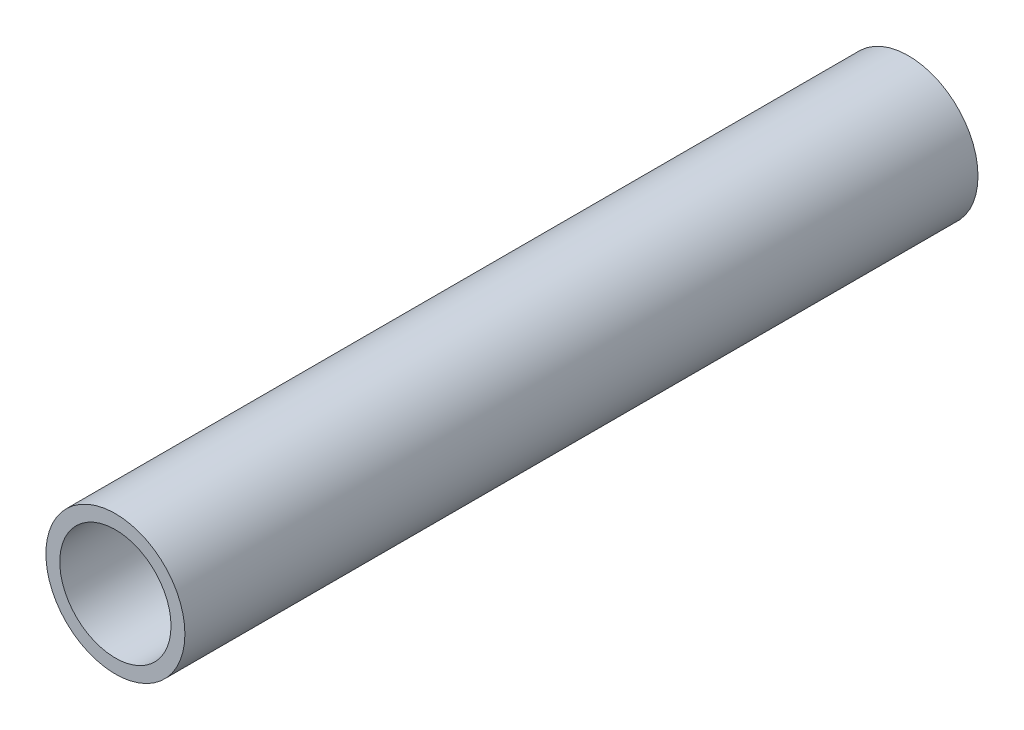
ISO-10303-21;
HEADER;
FILE_DESCRIPTION(('STEP AP214'),'2;1');
FILE_NAME('part.step','',(''),(''),'','','');
FILE_SCHEMA(('AUTOMOTIVE_DESIGN { 1 0 10303 214 1 1 1 1 }'));
ENDSEC;
DATA;
#1=APPLICATION_CONTEXT('core data for automotive mechanical design processes');
#2=APPLICATION_PROTOCOL_DEFINITION('international standard','automotive_design',2000,#1);
#3=PRODUCT_CONTEXT('',#1,'mechanical');
#4=PRODUCT('Part','Part','',(#3));
#5=PRODUCT_RELATED_PRODUCT_CATEGORY('part','',(#4));
#6=PRODUCT_DEFINITION_FORMATION('','',#4);
#7=PRODUCT_DEFINITION_CONTEXT('part definition',#1,'design');
#8=PRODUCT_DEFINITION('design','',#6,#7);
#9=PRODUCT_DEFINITION_SHAPE('','',#8);
#10=(LENGTH_UNIT() NAMED_UNIT(*) SI_UNIT(.MILLI.,.METRE.));
#11=(NAMED_UNIT(*) PLANE_ANGLE_UNIT() SI_UNIT($,.RADIAN.));
#12=(NAMED_UNIT(*) SI_UNIT($,.STERADIAN.) SOLID_ANGLE_UNIT());
#13=UNCERTAINTY_MEASURE_WITH_UNIT(LENGTH_MEASURE(1.E-05),#10,'distance_accuracy_value','');
#14=(GEOMETRIC_REPRESENTATION_CONTEXT(3) GLOBAL_UNCERTAINTY_ASSIGNED_CONTEXT((#13)) GLOBAL_UNIT_ASSIGNED_CONTEXT((#10,
#11,#12)) REPRESENTATION_CONTEXT('',''));
#15=CARTESIAN_POINT('',(0.,0.,0.));
#16=DIRECTION('',(0.,0.,1.));
#17=DIRECTION('',(1.,0.,0.));
#18=AXIS2_PLACEMENT_3D('',#15,#16,#17);
#19=CARTESIAN_POINT('',(0.,0.,14.26));
#20=DIRECTION('',(0.,0.,1.));
#21=DIRECTION('',(1.,0.,0.));
#22=AXIS2_PLACEMENT_3D('',#19,#20,#21);
#23=PLANE('',#22);
#24=CARTESIAN_POINT('',(0.,0.,14.26));
#25=DIRECTION('',(0.,0.,1.));
#26=DIRECTION('',(1.,0.,0.));
#27=AXIS2_PLACEMENT_3D('',#24,#25,#26);
#28=CIRCLE('',#27,1.25);
#29=CARTESIAN_POINT('',(1.25,0.,14.26));
#30=VERTEX_POINT('',#29);
#31=EDGE_CURVE('E10',#30,#30,#28,.T.);
#32=ORIENTED_EDGE('',*,*,#31,.T.);
#33=EDGE_LOOP('',(#32));
#34=FACE_BOUND('',#33,.T.);
#35=CARTESIAN_POINT('',(0.,0.,14.26));
#36=DIRECTION('',(0.,0.,1.));
#37=DIRECTION('',(1.,0.,0.));
#38=AXIS2_PLACEMENT_3D('',#35,#36,#37);
#39=CIRCLE('',#38,1.);
#40=CARTESIAN_POINT('',(1.,0.,14.26));
#41=VERTEX_POINT('',#40);
#42=EDGE_CURVE('E42',#41,#41,#39,.T.);
#43=ORIENTED_EDGE('',*,*,#42,.F.);
#44=EDGE_LOOP('',(#43));
#45=FACE_BOUND('',#44,.T.);
#46=ADVANCED_FACE('F31',(#34,#45),#23,.T.);
#47=CARTESIAN_POINT('',(0.,0.,0.));
#48=DIRECTION('',(0.,0.,1.));
#49=DIRECTION('',(1.,0.,0.));
#50=AXIS2_PLACEMENT_3D('',#47,#48,#49);
#51=PLANE('',#50);
#52=CARTESIAN_POINT('',(0.,0.,0.));
#53=DIRECTION('',(0.,0.,1.));
#54=DIRECTION('',(1.,0.,0.));
#55=AXIS2_PLACEMENT_3D('',#52,#53,#54);
#56=CIRCLE('',#55,1.25);
#57=CARTESIAN_POINT('',(1.25,0.,0.));
#58=VERTEX_POINT('',#57);
#59=EDGE_CURVE('E35',#58,#58,#56,.T.);
#60=ORIENTED_EDGE('',*,*,#59,.F.);
#61=EDGE_LOOP('',(#60));
#62=FACE_BOUND('',#61,.T.);
#63=CARTESIAN_POINT('',(0.,0.,0.));
#64=DIRECTION('',(0.,0.,1.));
#65=DIRECTION('',(1.,0.,0.));
#66=AXIS2_PLACEMENT_3D('',#63,#64,#65);
#67=CIRCLE('',#66,1.);
#68=CARTESIAN_POINT('',(1.,0.,0.));
#69=VERTEX_POINT('',#68);
#70=EDGE_CURVE('E44',#69,#69,#67,.T.);
#71=ORIENTED_EDGE('',*,*,#70,.T.);
#72=EDGE_LOOP('',(#71));
#73=FACE_BOUND('',#72,.T.);
#74=ADVANCED_FACE('F54',(#62,#73),#51,.F.);
#75=CARTESIAN_POINT('',(0.,0.,14.26));
#76=DIRECTION('',(0.,0.,-1.));
#77=DIRECTION('',(-1.,0.,0.));
#78=AXIS2_PLACEMENT_3D('',#75,#76,#77);
#79=CYLINDRICAL_SURFACE('',#78,1.25);
#80=ORIENTED_EDGE('',*,*,#31,.F.);
#81=EDGE_LOOP('',(#80));
#82=FACE_BOUND('',#81,.T.);
#83=ORIENTED_EDGE('',*,*,#59,.T.);
#84=EDGE_LOOP('',(#83));
#85=FACE_BOUND('',#84,.T.);
#86=ADVANCED_FACE('F33',(#82,#85),#79,.T.);
#87=CARTESIAN_POINT('',(0.,0.,14.26));
#88=DIRECTION('',(0.,0.,-1.));
#89=DIRECTION('',(-1.,0.,0.));
#90=AXIS2_PLACEMENT_3D('',#87,#88,#89);
#91=CYLINDRICAL_SURFACE('',#90,1.);
#92=ORIENTED_EDGE('',*,*,#42,.T.);
#93=EDGE_LOOP('',(#92));
#94=FACE_BOUND('',#93,.T.);
#95=ORIENTED_EDGE('',*,*,#70,.F.);
#96=EDGE_LOOP('',(#95));
#97=FACE_BOUND('',#96,.T.);
#98=ADVANCED_FACE('F50',(#94,#97),#91,.F.);
#99=CLOSED_SHELL('',(#46,#74,#86,#98));
#100=MANIFOLD_SOLID_BREP('B2',#99);
#101=ADVANCED_BREP_SHAPE_REPRESENTATION('',(#18,#100),#14);
#102=SHAPE_DEFINITION_REPRESENTATION(#9,#101);
ENDSEC;
END-ISO-10303-21;
